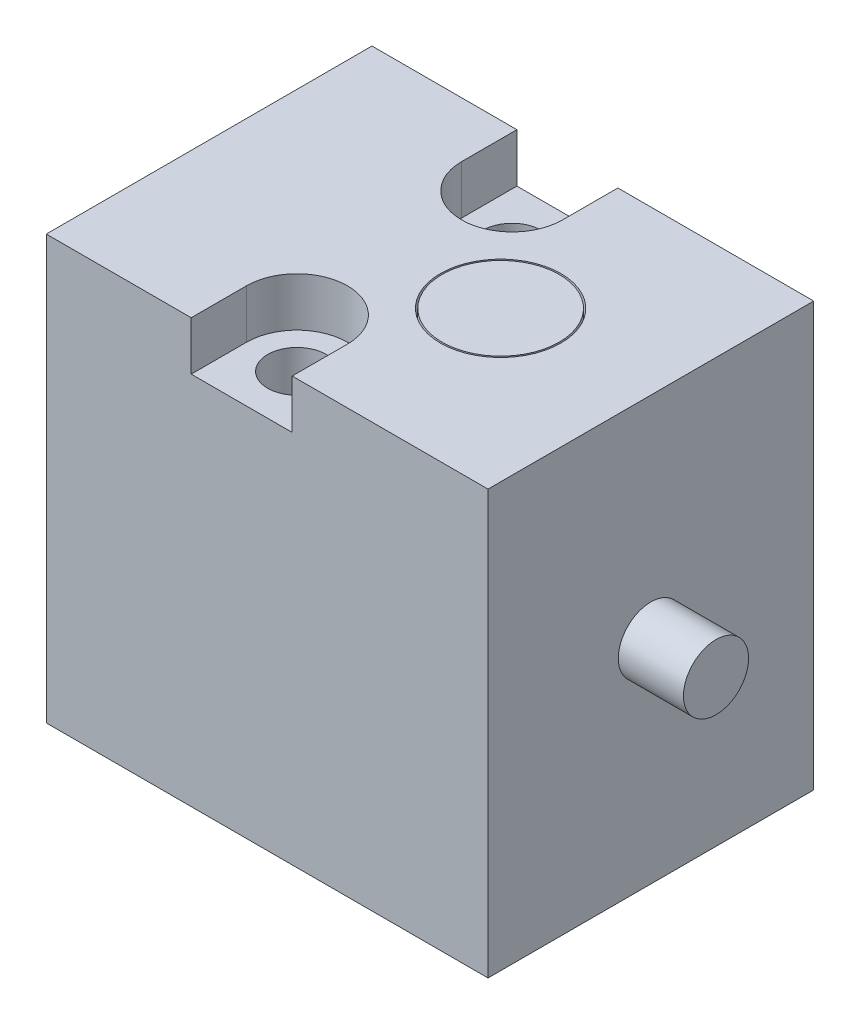
ISO-10303-21;
HEADER;
FILE_DESCRIPTION(('STEP AP214'),'2;1');
FILE_NAME('part.step','',(''),(''),'','','');
FILE_SCHEMA(('AUTOMOTIVE_DESIGN { 1 0 10303 214 1 1 1 1 }'));
ENDSEC;
DATA;
#1=APPLICATION_CONTEXT('core data for automotive mechanical design processes');
#2=APPLICATION_PROTOCOL_DEFINITION('international standard','automotive_design',2000,#1);
#3=PRODUCT_CONTEXT('',#1,'mechanical');
#4=PRODUCT('Part','Part','',(#3));
#5=PRODUCT_RELATED_PRODUCT_CATEGORY('part','',(#4));
#6=PRODUCT_DEFINITION_FORMATION('','',#4);
#7=PRODUCT_DEFINITION_CONTEXT('part definition',#1,'design');
#8=PRODUCT_DEFINITION('design','',#6,#7);
#9=PRODUCT_DEFINITION_SHAPE('','',#8);
#10=(LENGTH_UNIT() NAMED_UNIT(*) SI_UNIT(.MILLI.,.METRE.));
#11=(NAMED_UNIT(*) PLANE_ANGLE_UNIT() SI_UNIT($,.RADIAN.));
#12=(NAMED_UNIT(*) SI_UNIT($,.STERADIAN.) SOLID_ANGLE_UNIT());
#13=UNCERTAINTY_MEASURE_WITH_UNIT(LENGTH_MEASURE(1.E-05),#10,'distance_accuracy_value','');
#14=(GEOMETRIC_REPRESENTATION_CONTEXT(3) GLOBAL_UNCERTAINTY_ASSIGNED_CONTEXT((#13)) GLOBAL_UNIT_ASSIGNED_CONTEXT((#10,
#11,#12)) REPRESENTATION_CONTEXT('',''));
#15=CARTESIAN_POINT('',(0.,0.,0.));
#16=DIRECTION('',(0.,0.,1.));
#17=DIRECTION('',(1.,0.,0.));
#18=AXIS2_PLACEMENT_3D('',#15,#16,#17);
#19=CARTESIAN_POINT('',(8.95,12.75,0.));
#20=DIRECTION('',(0.,1.,0.));
#21=DIRECTION('',(1.,0.,0.));
#22=AXIS2_PLACEMENT_3D('',#19,#20,#21);
#23=CYLINDRICAL_SURFACE('',#22,1.8);
#24=CARTESIAN_POINT('',(8.95,13.,0.));
#25=DIRECTION('',(0.,1.,0.));
#26=DIRECTION('',(1.,0.,0.));
#27=AXIS2_PLACEMENT_3D('',#24,#25,#26);
#28=CIRCLE('',#27,1.8);
#29=CARTESIAN_POINT('',(10.75,13.,0.));
#30=VERTEX_POINT('',#29);
#31=EDGE_CURVE('E11',#30,#30,#28,.T.);
#32=ORIENTED_EDGE('',*,*,#31,.F.);
#33=EDGE_LOOP('',(#32));
#34=FACE_BOUND('',#33,.T.);
#35=CARTESIAN_POINT('',(8.95,12.5,0.));
#36=DIRECTION('',(0.,-1.,0.));
#37=DIRECTION('',(1.,0.,0.));
#38=AXIS2_PLACEMENT_3D('',#35,#36,#37);
#39=CIRCLE('',#38,1.8);
#40=CARTESIAN_POINT('',(10.75,12.5,0.));
#41=VERTEX_POINT('',#40);
#42=EDGE_CURVE('E195',#41,#41,#39,.T.);
#43=ORIENTED_EDGE('',*,*,#42,.F.);
#44=EDGE_LOOP('',(#43));
#45=FACE_BOUND('',#44,.T.);
#46=ADVANCED_FACE('F16',(#34,#45),#23,.T.);
#47=CARTESIAN_POINT('',(8.95,13.,0.));
#48=DIRECTION('',(0.,1.,0.));
#49=DIRECTION('',(-1.,0.,0.));
#50=AXIS2_PLACEMENT_3D('',#47,#48,#49);
#51=PLANE('',#50);
#52=ORIENTED_EDGE('',*,*,#31,.T.);
#53=EDGE_LOOP('',(#52));
#54=FACE_BOUND('',#53,.T.);
#55=ADVANCED_FACE('F346',(#54),#51,.T.);
#56=CARTESIAN_POINT('',(13.563,6.50000000000001,0.));
#57=DIRECTION('',(-1.,0.,0.));
#58=DIRECTION('',(0.,0.,-1.));
#59=AXIS2_PLACEMENT_3D('',#56,#57,#58);
#60=CYLINDRICAL_SURFACE('',#59,1.);
#61=CARTESIAN_POINT('',(15.563,6.50000000000001,0.));
#62=DIRECTION('',(1.,0.,0.));
#63=DIRECTION('',(0.,0.,-1.));
#64=AXIS2_PLACEMENT_3D('',#61,#62,#63);
#65=CIRCLE('',#64,1.);
#66=CARTESIAN_POINT('',(15.563,6.50000000000001,-1.));
#67=VERTEX_POINT('',#66);
#68=EDGE_CURVE('E25',#67,#67,#65,.T.);
#69=ORIENTED_EDGE('',*,*,#68,.F.);
#70=EDGE_LOOP('',(#69));
#71=FACE_BOUND('',#70,.T.);
#72=CARTESIAN_POINT('',(13.563,6.50000000000001,0.));
#73=DIRECTION('',(-1.,0.,0.));
#74=DIRECTION('',(0.,0.,-1.));
#75=AXIS2_PLACEMENT_3D('',#72,#73,#74);
#76=CIRCLE('',#75,1.);
#77=CARTESIAN_POINT('',(13.563,6.50000000000001,1.));
#78=VERTEX_POINT('',#77);
#79=EDGE_CURVE('E175',#78,#78,#76,.T.);
#80=ORIENTED_EDGE('',*,*,#79,.F.);
#81=EDGE_LOOP('',(#80));
#82=FACE_BOUND('',#81,.T.);
#83=ADVANCED_FACE('F350',(#71,#82),#60,.T.);
#84=CARTESIAN_POINT('',(15.563,6.50000000000001,0.));
#85=DIRECTION('',(1.,0.,0.));
#86=DIRECTION('',(0.,0.,-1.));
#87=AXIS2_PLACEMENT_3D('',#84,#85,#86);
#88=PLANE('',#87);
#89=ORIENTED_EDGE('',*,*,#68,.T.);
#90=EDGE_LOOP('',(#89));
#91=FACE_BOUND('',#90,.T.);
#92=ADVANCED_FACE('F363',(#91),#88,.T.);
#93=CARTESIAN_POINT('',(8.95,13.25,0.));
#94=DIRECTION('',(0.,1.,0.));
#95=DIRECTION('',(1.,0.,0.));
#96=AXIS2_PLACEMENT_3D('',#93,#94,#95);
#97=CYLINDRICAL_SURFACE('',#96,1.85);
#98=CARTESIAN_POINT('',(8.95,13.,0.));
#99=DIRECTION('',(0.,-1.,0.));
#100=DIRECTION('',(1.,0.,0.));
#101=AXIS2_PLACEMENT_3D('',#98,#99,#100);
#102=CIRCLE('',#101,1.85);
#103=CARTESIAN_POINT('',(7.1,13.,0.));
#104=VERTEX_POINT('',#103);
#105=EDGE_CURVE('E221',#104,#104,#102,.T.);
#106=ORIENTED_EDGE('',*,*,#105,.F.);
#107=EDGE_LOOP('',(#106));
#108=FACE_BOUND('',#107,.T.);
#109=CARTESIAN_POINT('',(8.95,12.5,0.));
#110=DIRECTION('',(0.,-1.,0.));
#111=DIRECTION('',(1.,0.,0.));
#112=AXIS2_PLACEMENT_3D('',#109,#110,#111);
#113=CIRCLE('',#112,1.85);
#114=CARTESIAN_POINT('',(10.8,12.5,0.));
#115=VERTEX_POINT('',#114);
#116=EDGE_CURVE('E198',#115,#115,#113,.T.);
#117=ORIENTED_EDGE('',*,*,#116,.T.);
#118=EDGE_LOOP('',(#117));
#119=FACE_BOUND('',#118,.T.);
#120=ADVANCED_FACE('F359',(#108,#119),#97,.F.);
#121=CARTESIAN_POINT('',(8.95,12.5,0.));
#122=DIRECTION('',(0.,-1.,0.));
#123=DIRECTION('',(1.,0.,0.));
#124=AXIS2_PLACEMENT_3D('',#121,#122,#123);
#125=PLANE('',#124);
#126=ORIENTED_EDGE('',*,*,#42,.T.);
#127=EDGE_LOOP('',(#126));
#128=FACE_BOUND('',#127,.T.);
#129=ORIENTED_EDGE('',*,*,#116,.F.);
#130=EDGE_LOOP('',(#129));
#131=FACE_BOUND('',#130,.T.);
#132=ADVANCED_FACE('F355',(#128,#131),#125,.F.);
#133=CARTESIAN_POINT('',(9.7846,2.,0.));
#134=DIRECTION('',(0.,-1.,0.));
#135=DIRECTION('',(1.,0.,0.));
#136=AXIS2_PLACEMENT_3D('',#133,#134,#135);
#137=CYLINDRICAL_SURFACE('',#136,0.6);
#138=CARTESIAN_POINT('',(9.7846,0.,0.));
#139=DIRECTION('',(0.,1.,0.));
#140=DIRECTION('',(1.,0.,0.));
#141=AXIS2_PLACEMENT_3D('',#138,#139,#140);
#142=CIRCLE('',#141,0.6);
#143=CARTESIAN_POINT('',(9.1846,0.,0.));
#144=VERTEX_POINT('',#143);
#145=EDGE_CURVE('E230',#144,#144,#142,.T.);
#146=ORIENTED_EDGE('',*,*,#145,.F.);
#147=EDGE_LOOP('',(#146));
#148=FACE_BOUND('',#147,.T.);
#149=CARTESIAN_POINT('',(9.7846,5.,0.));
#150=DIRECTION('',(0.,1.,0.));
#151=DIRECTION('',(1.,0.,0.));
#152=AXIS2_PLACEMENT_3D('',#149,#150,#151);
#153=CIRCLE('',#152,0.6);
#154=CARTESIAN_POINT('',(10.3846,5.,0.));
#155=VERTEX_POINT('',#154);
#156=EDGE_CURVE('E199',#155,#155,#153,.T.);
#157=ORIENTED_EDGE('',*,*,#156,.T.);
#158=EDGE_LOOP('',(#157));
#159=FACE_BOUND('',#158,.T.);
#160=ADVANCED_FACE('F358',(#148,#159),#137,.F.);
#161=CARTESIAN_POINT('',(9.7846,5.,0.));
#162=DIRECTION('',(0.,1.,0.));
#163=DIRECTION('',(1.,0.,0.));
#164=AXIS2_PLACEMENT_3D('',#161,#162,#163);
#165=PLANE('',#164);
#166=ORIENTED_EDGE('',*,*,#156,.F.);
#167=EDGE_LOOP('',(#166));
#168=FACE_BOUND('',#167,.T.);
#169=ADVANCED_FACE('F379',(#168),#165,.F.);
#170=CARTESIAN_POINT('',(7.143,2.,0.));
#171=DIRECTION('',(0.,-1.,0.));
#172=DIRECTION('',(1.,0.,0.));
#173=AXIS2_PLACEMENT_3D('',#170,#171,#172);
#174=CYLINDRICAL_SURFACE('',#173,0.6);
#175=CARTESIAN_POINT('',(7.143,0.,0.));
#176=DIRECTION('',(0.,1.,0.));
#177=DIRECTION('',(1.,0.,0.));
#178=AXIS2_PLACEMENT_3D('',#175,#176,#177);
#179=CIRCLE('',#178,0.6);
#180=CARTESIAN_POINT('',(6.54299999999999,0.,0.));
#181=VERTEX_POINT('',#180);
#182=EDGE_CURVE('E271',#181,#181,#179,.T.);
#183=ORIENTED_EDGE('',*,*,#182,.F.);
#184=EDGE_LOOP('',(#183));
#185=FACE_BOUND('',#184,.T.);
#186=CARTESIAN_POINT('',(7.143,5.,0.));
#187=DIRECTION('',(0.,1.,0.));
#188=DIRECTION('',(1.,0.,0.));
#189=AXIS2_PLACEMENT_3D('',#186,#187,#188);
#190=CIRCLE('',#189,0.6);
#191=CARTESIAN_POINT('',(7.743,5.,0.));
#192=VERTEX_POINT('',#191);
#193=EDGE_CURVE('E19',#192,#192,#190,.T.);
#194=ORIENTED_EDGE('',*,*,#193,.T.);
#195=EDGE_LOOP('',(#194));
#196=FACE_BOUND('',#195,.T.);
#197=ADVANCED_FACE('F382',(#185,#196),#174,.F.);
#198=CARTESIAN_POINT('',(7.143,5.,0.));
#199=DIRECTION('',(0.,1.,0.));
#200=DIRECTION('',(1.,0.,0.));
#201=AXIS2_PLACEMENT_3D('',#198,#199,#200);
#202=PLANE('',#201);
#203=ORIENTED_EDGE('',*,*,#193,.F.);
#204=EDGE_LOOP('',(#203));
#205=FACE_BOUND('',#204,.T.);
#206=ADVANCED_FACE('F416',(#205),#202,.F.);
#207=CARTESIAN_POINT('',(4.5014,2.,0.));
#208=DIRECTION('',(0.,-1.,0.));
#209=DIRECTION('',(1.,0.,0.));
#210=AXIS2_PLACEMENT_3D('',#207,#208,#209);
#211=CYLINDRICAL_SURFACE('',#210,0.6);
#212=CARTESIAN_POINT('',(4.5014,0.,0.));
#213=DIRECTION('',(0.,1.,0.));
#214=DIRECTION('',(1.,0.,0.));
#215=AXIS2_PLACEMENT_3D('',#212,#213,#214);
#216=CIRCLE('',#215,0.6);
#217=CARTESIAN_POINT('',(3.9014,0.,0.));
#218=VERTEX_POINT('',#217);
#219=EDGE_CURVE('E220',#218,#218,#216,.T.);
#220=ORIENTED_EDGE('',*,*,#219,.F.);
#221=EDGE_LOOP('',(#220));
#222=FACE_BOUND('',#221,.T.);
#223=CARTESIAN_POINT('',(4.5014,5.,0.));
#224=DIRECTION('',(0.,1.,0.));
#225=DIRECTION('',(1.,0.,0.));
#226=AXIS2_PLACEMENT_3D('',#223,#224,#225);
#227=CIRCLE('',#226,0.6);
#228=CARTESIAN_POINT('',(5.10140000000001,5.,0.));
#229=VERTEX_POINT('',#228);
#230=EDGE_CURVE('E240',#229,#229,#227,.T.);
#231=ORIENTED_EDGE('',*,*,#230,.T.);
#232=EDGE_LOOP('',(#231));
#233=FACE_BOUND('',#232,.T.);
#234=ADVANCED_FACE('F444',(#222,#233),#211,.F.);
#235=CARTESIAN_POINT('',(4.5014,5.,0.));
#236=DIRECTION('',(0.,1.,0.));
#237=DIRECTION('',(1.,0.,0.));
#238=AXIS2_PLACEMENT_3D('',#235,#236,#237);
#239=PLANE('',#238);
#240=ORIENTED_EDGE('',*,*,#230,.F.);
#241=EDGE_LOOP('',(#240));
#242=FACE_BOUND('',#241,.T.);
#243=ADVANCED_FACE('F377',(#242),#239,.F.);
#244=CARTESIAN_POINT('',(-0.375,6.50000000000001,0.));
#245=DIRECTION('',(-1.,0.,0.));
#246=DIRECTION('',(0.,0.,-1.));
#247=AXIS2_PLACEMENT_3D('',#244,#245,#246);
#248=CYLINDRICAL_SURFACE('',#247,3.4);
#249=CARTESIAN_POINT('',(0.,6.50000000000001,0.));
#250=DIRECTION('',(1.,0.,0.));
#251=DIRECTION('',(0.,0.,-1.));
#252=AXIS2_PLACEMENT_3D('',#249,#250,#251);
#253=CIRCLE('',#252,3.4);
#254=CARTESIAN_POINT('',(0.,6.50000000000001,3.39999999999999));
#255=VERTEX_POINT('',#254);
#256=EDGE_CURVE('E190',#255,#255,#253,.T.);
#257=ORIENTED_EDGE('',*,*,#256,.F.);
#258=EDGE_LOOP('',(#257));
#259=FACE_BOUND('',#258,.T.);
#260=CARTESIAN_POINT('',(0.25,6.50000000000001,0.));
#261=DIRECTION('',(1.,0.,0.));
#262=DIRECTION('',(0.,0.,-1.));
#263=AXIS2_PLACEMENT_3D('',#260,#261,#262);
#264=CIRCLE('',#263,3.4);
#265=CARTESIAN_POINT('',(0.25,6.50000000000001,-3.39999999999999));
#266=VERTEX_POINT('',#265);
#267=EDGE_CURVE('E243',#266,#266,#264,.T.);
#268=ORIENTED_EDGE('',*,*,#267,.T.);
#269=EDGE_LOOP('',(#268));
#270=FACE_BOUND('',#269,.T.);
#271=ADVANCED_FACE('F373',(#259,#270),#248,.F.);
#272=CARTESIAN_POINT('',(0.25,6.50000000000001,0.));
#273=DIRECTION('',(1.,0.,0.));
#274=DIRECTION('',(0.,0.,-1.));
#275=AXIS2_PLACEMENT_3D('',#272,#273,#274);
#276=PLANE('',#275);
#277=ORIENTED_EDGE('',*,*,#267,.F.);
#278=EDGE_LOOP('',(#277));
#279=FACE_BOUND('',#278,.T.);
#280=ADVANCED_FACE('F376',(#279),#276,.F.);
#281=CARTESIAN_POINT('',(6.00000000000001,7.00000000000001,3.302));
#282=DIRECTION('',(0.,-1.,0.));
#283=DIRECTION('',(1.,0.,0.));
#284=AXIS2_PLACEMENT_3D('',#281,#282,#283);
#285=CYLINDRICAL_SURFACE('',#284,0.9);
#286=CARTESIAN_POINT('',(6.00000000000001,0.,3.302));
#287=DIRECTION('',(0.,1.,0.));
#288=DIRECTION('',(1.,0.,0.));
#289=AXIS2_PLACEMENT_3D('',#286,#287,#288);
#290=CIRCLE('',#289,0.9);
#291=CARTESIAN_POINT('',(5.09999999999999,0.,3.302));
#292=VERTEX_POINT('',#291);
#293=EDGE_CURVE('E217',#292,#292,#290,.T.);
#294=ORIENTED_EDGE('',*,*,#293,.F.);
#295=EDGE_LOOP('',(#294));
#296=FACE_BOUND('',#295,.T.);
#297=CARTESIAN_POINT('',(6.00000000000001,11.5,3.302));
#298=DIRECTION('',(0.,-1.,0.));
#299=DIRECTION('',(1.,0.,0.));
#300=AXIS2_PLACEMENT_3D('',#297,#298,#299);
#301=CIRCLE('',#300,0.9);
#302=CARTESIAN_POINT('',(5.09999999999999,11.5,3.302));
#303=VERTEX_POINT('',#302);
#304=EDGE_CURVE('E253',#303,#303,#301,.T.);
#305=ORIENTED_EDGE('',*,*,#304,.F.);
#306=EDGE_LOOP('',(#305));
#307=FACE_BOUND('',#306,.T.);
#308=ADVANCED_FACE('F401',(#296,#307),#285,.F.);
#309=CARTESIAN_POINT('',(6.00000000000001,7.00000000000001,-3.302));
#310=DIRECTION('',(0.,-1.,0.));
#311=DIRECTION('',(1.,0.,0.));
#312=AXIS2_PLACEMENT_3D('',#309,#310,#311);
#313=CYLINDRICAL_SURFACE('',#312,0.9);
#314=CARTESIAN_POINT('',(6.00000000000001,0.,-3.302));
#315=DIRECTION('',(0.,1.,0.));
#316=DIRECTION('',(1.,0.,0.));
#317=AXIS2_PLACEMENT_3D('',#314,#315,#316);
#318=CIRCLE('',#317,0.9);
#319=CARTESIAN_POINT('',(5.09999999999999,0.,-3.302));
#320=VERTEX_POINT('',#319);
#321=EDGE_CURVE('E189',#320,#320,#318,.T.);
#322=ORIENTED_EDGE('',*,*,#321,.F.);
#323=EDGE_LOOP('',(#322));
#324=FACE_BOUND('',#323,.T.);
#325=CARTESIAN_POINT('',(6.00000000000001,11.5,-3.302));
#326=DIRECTION('',(0.,-1.,0.));
#327=DIRECTION('',(1.,0.,0.));
#328=AXIS2_PLACEMENT_3D('',#325,#326,#327);
#329=CIRCLE('',#328,0.9);
#330=CARTESIAN_POINT('',(5.09999999999999,11.5,-3.302));
#331=VERTEX_POINT('',#330);
#332=EDGE_CURVE('E183',#331,#331,#329,.T.);
#333=ORIENTED_EDGE('',*,*,#332,.F.);
#334=EDGE_LOOP('',(#333));
#335=FACE_BOUND('',#334,.T.);
#336=ADVANCED_FACE('F406',(#324,#335),#313,.F.);
#337=CARTESIAN_POINT('',(6.00000000000001,12.75,3.302));
#338=DIRECTION('',(0.,1.,0.));
#339=DIRECTION('',(1.,0.,0.));
#340=AXIS2_PLACEMENT_3D('',#337,#338,#339);
#341=CYLINDRICAL_SURFACE('',#340,1.55);
#342=CARTESIAN_POINT('',(6.00000000000001,13.,3.302));
#343=DIRECTION('',(0.,-1.,0.));
#344=DIRECTION('',(1.,0.,0.));
#345=AXIS2_PLACEMENT_3D('',#342,#343,#344);
#346=CIRCLE('',#345,1.55);
#347=CARTESIAN_POINT('',(4.45,13.,3.302));
#348=VERTEX_POINT('',#347);
#349=CARTESIAN_POINT('',(7.55,13.,3.302));
#350=VERTEX_POINT('',#349);
#351=EDGE_CURVE('E247',#348,#350,#346,.T.);
#352=ORIENTED_EDGE('',*,*,#351,.F.);
#353=DIRECTION('',(0.,1.,0.));
#354=VECTOR('',#353,1.);
#355=CARTESIAN_POINT('',(4.45,12.75,3.302));
#356=LINE('',#355,#354);
#357=CARTESIAN_POINT('',(4.45,11.5,3.302));
#358=VERTEX_POINT('',#357);
#359=EDGE_CURVE('E269',#358,#348,#356,.T.);
#360=ORIENTED_EDGE('',*,*,#359,.F.);
#361=CARTESIAN_POINT('',(6.00000000000001,11.5,3.302));
#362=DIRECTION('',(0.,-1.,0.));
#363=DIRECTION('',(1.,0.,0.));
#364=AXIS2_PLACEMENT_3D('',#361,#362,#363);
#365=CIRCLE('',#364,1.55);
#366=CARTESIAN_POINT('',(7.55,11.5,3.302));
#367=VERTEX_POINT('',#366);
#368=EDGE_CURVE('E214',#358,#367,#365,.T.);
#369=ORIENTED_EDGE('',*,*,#368,.T.);
#370=DIRECTION('',(0.,-1.,0.));
#371=VECTOR('',#370,1.);
#372=CARTESIAN_POINT('',(7.55,12.75,3.302));
#373=LINE('',#372,#371);
#374=EDGE_CURVE('E212',#350,#367,#373,.T.);
#375=ORIENTED_EDGE('',*,*,#374,.F.);
#376=EDGE_LOOP('',(#352,#360,#369,#375));
#377=FACE_BOUND('',#376,.T.);
#378=ADVANCED_FACE('F309',(#377),#341,.F.);
#379=CARTESIAN_POINT('',(7.55,14.,5.802));
#380=DIRECTION('',(-1.,0.,0.));
#381=DIRECTION('',(0.,0.,1.));
#382=AXIS2_PLACEMENT_3D('',#379,#380,#381);
#383=PLANE('',#382);
#384=DIRECTION('',(0.,0.,1.));
#385=VECTOR('',#384,1.);
#386=CARTESIAN_POINT('',(7.55,13.,2.90099999999999));
#387=LINE('',#386,#385);
#388=CARTESIAN_POINT('',(7.55,13.,5.));
#389=VERTEX_POINT('',#388);
#390=EDGE_CURVE('E244',#350,#389,#387,.T.);
#391=ORIENTED_EDGE('',*,*,#390,.F.);
#392=ORIENTED_EDGE('',*,*,#374,.T.);
#393=DIRECTION('',(0.,0.,-1.));
#394=VECTOR('',#393,1.);
#395=CARTESIAN_POINT('',(7.55,11.5,5.802));
#396=LINE('',#395,#394);
#397=CARTESIAN_POINT('',(7.55,11.5,5.));
#398=VERTEX_POINT('',#397);
#399=EDGE_CURVE('E224',#398,#367,#396,.T.);
#400=ORIENTED_EDGE('',*,*,#399,.F.);
#401=DIRECTION('',(0.,-1.,0.));
#402=VECTOR('',#401,1.);
#403=CARTESIAN_POINT('',(7.55,10.25,5.));
#404=LINE('',#403,#402);
#405=EDGE_CURVE('E229',#389,#398,#404,.T.);
#406=ORIENTED_EDGE('',*,*,#405,.F.);
#407=EDGE_LOOP('',(#391,#392,#400,#406));
#408=FACE_BOUND('',#407,.T.);
#409=ADVANCED_FACE('F313',(#408),#383,.T.);
#410=CARTESIAN_POINT('',(4.45,14.,5.802));
#411=DIRECTION('',(1.,0.,0.));
#412=DIRECTION('',(0.,0.,-1.));
#413=AXIS2_PLACEMENT_3D('',#410,#411,#412);
#414=PLANE('',#413);
#415=DIRECTION('',(0.,0.,-1.));
#416=VECTOR('',#415,1.);
#417=CARTESIAN_POINT('',(4.45,13.,2.90099999999999));
#418=LINE('',#417,#416);
#419=CARTESIAN_POINT('',(4.45,13.,5.));
#420=VERTEX_POINT('',#419);
#421=EDGE_CURVE('E225',#420,#348,#418,.T.);
#422=ORIENTED_EDGE('',*,*,#421,.F.);
#423=DIRECTION('',(0.,1.,0.));
#424=VECTOR('',#423,1.);
#425=CARTESIAN_POINT('',(4.45,10.25,5.));
#426=LINE('',#425,#424);
#427=CARTESIAN_POINT('',(4.45,11.5,5.));
#428=VERTEX_POINT('',#427);
#429=EDGE_CURVE('E254',#428,#420,#426,.T.);
#430=ORIENTED_EDGE('',*,*,#429,.F.);
#431=DIRECTION('',(0.,0.,-1.));
#432=VECTOR('',#431,1.);
#433=CARTESIAN_POINT('',(4.45,11.5,5.802));
#434=LINE('',#433,#432);
#435=EDGE_CURVE('E215',#428,#358,#434,.T.);
#436=ORIENTED_EDGE('',*,*,#435,.T.);
#437=ORIENTED_EDGE('',*,*,#359,.T.);
#438=EDGE_LOOP('',(#422,#430,#436,#437));
#439=FACE_BOUND('',#438,.T.);
#440=ADVANCED_FACE('F388',(#439),#414,.T.);
#441=CARTESIAN_POINT('',(6.00000000000001,11.5,3.302));
#442=DIRECTION('',(0.,-1.,0.));
#443=DIRECTION('',(1.,0.,0.));
#444=AXIS2_PLACEMENT_3D('',#441,#442,#443);
#445=PLANE('',#444);
#446=ORIENTED_EDGE('',*,*,#304,.T.);
#447=EDGE_LOOP('',(#446));
#448=FACE_BOUND('',#447,.T.);
#449=DIRECTION('',(-1.,0.,0.));
#450=VECTOR('',#449,1.);
#451=CARTESIAN_POINT('',(6.39075,11.5,5.));
#452=LINE('',#451,#450);
#453=EDGE_CURVE('E226',#398,#428,#452,.T.);
#454=ORIENTED_EDGE('',*,*,#453,.F.);
#455=ORIENTED_EDGE('',*,*,#399,.T.);
#456=ORIENTED_EDGE('',*,*,#368,.F.);
#457=ORIENTED_EDGE('',*,*,#435,.F.);
#458=EDGE_LOOP('',(#454,#455,#456,#457));
#459=FACE_BOUND('',#458,.T.);
#460=ADVANCED_FACE('F391',(#448,#459),#445,.F.);
#461=CARTESIAN_POINT('',(6.7815,13.,0.));
#462=DIRECTION('',(0.,-1.,0.));
#463=DIRECTION('',(0.,0.,-1.));
#464=AXIS2_PLACEMENT_3D('',#461,#462,#463);
#465=PLANE('',#464);
#466=ORIENTED_EDGE('',*,*,#105,.T.);
#467=EDGE_LOOP('',(#466));
#468=FACE_BOUND('',#467,.T.);
#469=ORIENTED_EDGE('',*,*,#421,.T.);
#470=ORIENTED_EDGE('',*,*,#351,.T.);
#471=ORIENTED_EDGE('',*,*,#390,.T.);
#472=DIRECTION('',(-1.,0.,0.));
#473=VECTOR('',#472,1.);
#474=CARTESIAN_POINT('',(6.7815,13.,5.));
#475=LINE('',#474,#473);
#476=CARTESIAN_POINT('',(13.563,13.,5.));
#477=VERTEX_POINT('',#476);
#478=EDGE_CURVE('E160',#477,#389,#475,.T.);
#479=ORIENTED_EDGE('',*,*,#478,.F.);
#480=DIRECTION('',(0.,0.,-1.));
#481=VECTOR('',#480,1.);
#482=CARTESIAN_POINT('',(13.563,13.,0.));
#483=LINE('',#482,#481);
#484=CARTESIAN_POINT('',(13.563,13.,-5.));
#485=VERTEX_POINT('',#484);
#486=EDGE_CURVE('E156',#477,#485,#483,.T.);
#487=ORIENTED_EDGE('',*,*,#486,.T.);
#488=DIRECTION('',(1.,0.,0.));
#489=VECTOR('',#488,1.);
#490=CARTESIAN_POINT('',(6.7815,13.,-5.));
#491=LINE('',#490,#489);
#492=CARTESIAN_POINT('',(7.55,13.,-5.));
#493=VERTEX_POINT('',#492);
#494=EDGE_CURVE('E194',#493,#485,#491,.T.);
#495=ORIENTED_EDGE('',*,*,#494,.F.);
#496=DIRECTION('',(0.,0.,1.));
#497=VECTOR('',#496,1.);
#498=CARTESIAN_POINT('',(7.55,13.,-2.90099999999999));
#499=LINE('',#498,#497);
#500=CARTESIAN_POINT('',(7.55,13.,-3.302));
#501=VERTEX_POINT('',#500);
#502=EDGE_CURVE('E266',#493,#501,#499,.T.);
#503=ORIENTED_EDGE('',*,*,#502,.T.);
#504=CARTESIAN_POINT('',(6.00000000000001,13.,-3.302));
#505=DIRECTION('',(0.,-1.,0.));
#506=DIRECTION('',(1.,0.,0.));
#507=AXIS2_PLACEMENT_3D('',#504,#505,#506);
#508=CIRCLE('',#507,1.55);
#509=CARTESIAN_POINT('',(4.45,13.,-3.302));
#510=VERTEX_POINT('',#509);
#511=EDGE_CURVE('E203',#501,#510,#508,.T.);
#512=ORIENTED_EDGE('',*,*,#511,.T.);
#513=DIRECTION('',(0.,0.,-1.));
#514=VECTOR('',#513,1.);
#515=CARTESIAN_POINT('',(4.45,13.,-2.90099999999999));
#516=LINE('',#515,#514);
#517=CARTESIAN_POINT('',(4.45,13.,-5.));
#518=VERTEX_POINT('',#517);
#519=EDGE_CURVE('E200',#510,#518,#516,.T.);
#520=ORIENTED_EDGE('',*,*,#519,.T.);
#521=DIRECTION('',(1.,0.,0.));
#522=VECTOR('',#521,1.);
#523=CARTESIAN_POINT('',(6.7815,13.,-5.));
#524=LINE('',#523,#522);
#525=CARTESIAN_POINT('',(0.,13.,-5.));
#526=VERTEX_POINT('',#525);
#527=EDGE_CURVE('E233',#526,#518,#524,.T.);
#528=ORIENTED_EDGE('',*,*,#527,.F.);
#529=DIRECTION('',(0.,0.,-1.));
#530=VECTOR('',#529,1.);
#531=CARTESIAN_POINT('',(0.,13.,0.));
#532=LINE('',#531,#530);
#533=CARTESIAN_POINT('',(0.,13.,5.));
#534=VERTEX_POINT('',#533);
#535=EDGE_CURVE('E178',#534,#526,#532,.T.);
#536=ORIENTED_EDGE('',*,*,#535,.F.);
#537=DIRECTION('',(-1.,0.,0.));
#538=VECTOR('',#537,1.);
#539=CARTESIAN_POINT('',(6.7815,13.,5.));
#540=LINE('',#539,#538);
#541=EDGE_CURVE('E256',#420,#534,#540,.T.);
#542=ORIENTED_EDGE('',*,*,#541,.F.);
#543=EDGE_LOOP('',(#469,#470,#471,#479,#487,#495,#503,#512,#520,#528,#536,#542));
#544=FACE_BOUND('',#543,.T.);
#545=ADVANCED_FACE('F304',(#468,#544),#465,.F.);
#546=CARTESIAN_POINT('',(4.45,14.,-5.802));
#547=DIRECTION('',(1.,0.,0.));
#548=DIRECTION('',(0.,0.,-1.));
#549=AXIS2_PLACEMENT_3D('',#546,#547,#548);
#550=PLANE('',#549);
#551=ORIENTED_EDGE('',*,*,#519,.F.);
#552=DIRECTION('',(0.,-1.,0.));
#553=VECTOR('',#552,1.);
#554=CARTESIAN_POINT('',(4.45,12.75,-3.302));
#555=LINE('',#554,#553);
#556=CARTESIAN_POINT('',(4.45,11.5,-3.302));
#557=VERTEX_POINT('',#556);
#558=EDGE_CURVE('E204',#510,#557,#555,.T.);
#559=ORIENTED_EDGE('',*,*,#558,.T.);
#560=DIRECTION('',(0.,0.,-1.));
#561=VECTOR('',#560,1.);
#562=CARTESIAN_POINT('',(4.45,11.5,-5.802));
#563=LINE('',#562,#561);
#564=CARTESIAN_POINT('',(4.45,11.5,-5.));
#565=VERTEX_POINT('',#564);
#566=EDGE_CURVE('E186',#557,#565,#563,.T.);
#567=ORIENTED_EDGE('',*,*,#566,.T.);
#568=DIRECTION('',(0.,-1.,0.));
#569=VECTOR('',#568,1.);
#570=CARTESIAN_POINT('',(4.45,10.25,-5.));
#571=LINE('',#570,#569);
#572=EDGE_CURVE('E234',#518,#565,#571,.T.);
#573=ORIENTED_EDGE('',*,*,#572,.F.);
#574=EDGE_LOOP('',(#551,#559,#567,#573));
#575=FACE_BOUND('',#574,.T.);
#576=ADVANCED_FACE('F330',(#575),#550,.T.);
#577=CARTESIAN_POINT('',(6.00000000000001,11.5,-3.302));
#578=DIRECTION('',(0.,-1.,0.));
#579=DIRECTION('',(1.,0.,0.));
#580=AXIS2_PLACEMENT_3D('',#577,#578,#579);
#581=PLANE('',#580);
#582=ORIENTED_EDGE('',*,*,#332,.T.);
#583=EDGE_LOOP('',(#582));
#584=FACE_BOUND('',#583,.T.);
#585=DIRECTION('',(1.,0.,0.));
#586=VECTOR('',#585,1.);
#587=CARTESIAN_POINT('',(6.39075,11.5,-5.));
#588=LINE('',#587,#586);
#589=CARTESIAN_POINT('',(7.55,11.5,-5.));
#590=VERTEX_POINT('',#589);
#591=EDGE_CURVE('E237',#565,#590,#588,.T.);
#592=ORIENTED_EDGE('',*,*,#591,.F.);
#593=ORIENTED_EDGE('',*,*,#566,.F.);
#594=CARTESIAN_POINT('',(6.00000000000001,11.5,-3.302));
#595=DIRECTION('',(0.,-1.,0.));
#596=DIRECTION('',(1.,0.,0.));
#597=AXIS2_PLACEMENT_3D('',#594,#595,#596);
#598=CIRCLE('',#597,1.55);
#599=CARTESIAN_POINT('',(7.55,11.5,-3.302));
#600=VERTEX_POINT('',#599);
#601=EDGE_CURVE('E236',#600,#557,#598,.T.);
#602=ORIENTED_EDGE('',*,*,#601,.F.);
#603=DIRECTION('',(0.,0.,-1.));
#604=VECTOR('',#603,1.);
#605=CARTESIAN_POINT('',(7.55,11.5,-5.802));
#606=LINE('',#605,#604);
#607=EDGE_CURVE('E187',#600,#590,#606,.T.);
#608=ORIENTED_EDGE('',*,*,#607,.T.);
#609=EDGE_LOOP('',(#592,#593,#602,#608));
#610=FACE_BOUND('',#609,.T.);
#611=ADVANCED_FACE('F384',(#584,#610),#581,.F.);
#612=CARTESIAN_POINT('',(7.55,14.,-5.802));
#613=DIRECTION('',(-1.,0.,0.));
#614=DIRECTION('',(0.,0.,1.));
#615=AXIS2_PLACEMENT_3D('',#612,#613,#614);
#616=PLANE('',#615);
#617=ORIENTED_EDGE('',*,*,#502,.F.);
#618=DIRECTION('',(0.,1.,0.));
#619=VECTOR('',#618,1.);
#620=CARTESIAN_POINT('',(7.55,10.25,-5.));
#621=LINE('',#620,#619);
#622=EDGE_CURVE('E206',#590,#493,#621,.T.);
#623=ORIENTED_EDGE('',*,*,#622,.F.);
#624=ORIENTED_EDGE('',*,*,#607,.F.);
#625=DIRECTION('',(0.,1.,0.));
#626=VECTOR('',#625,1.);
#627=CARTESIAN_POINT('',(7.55,12.75,-3.302));
#628=LINE('',#627,#626);
#629=EDGE_CURVE('E209',#600,#501,#628,.T.);
#630=ORIENTED_EDGE('',*,*,#629,.T.);
#631=EDGE_LOOP('',(#617,#623,#624,#630));
#632=FACE_BOUND('',#631,.T.);
#633=ADVANCED_FACE('F322',(#632),#616,.T.);
#634=CARTESIAN_POINT('',(6.00000000000001,12.75,-3.302));
#635=DIRECTION('',(0.,1.,0.));
#636=DIRECTION('',(1.,0.,0.));
#637=AXIS2_PLACEMENT_3D('',#634,#635,#636);
#638=CYLINDRICAL_SURFACE('',#637,1.55);
#639=ORIENTED_EDGE('',*,*,#511,.F.);
#640=ORIENTED_EDGE('',*,*,#629,.F.);
#641=ORIENTED_EDGE('',*,*,#601,.T.);
#642=ORIENTED_EDGE('',*,*,#558,.F.);
#643=EDGE_LOOP('',(#639,#640,#641,#642));
#644=FACE_BOUND('',#643,.T.);
#645=ADVANCED_FACE('F328',(#644),#638,.F.);
#646=CARTESIAN_POINT('',(6.7815,6.50000000000001,-5.));
#647=DIRECTION('',(0.,0.,1.));
#648=DIRECTION('',(1.,0.,0.));
#649=AXIS2_PLACEMENT_3D('',#646,#647,#648);
#650=PLANE('',#649);
#651=ORIENTED_EDGE('',*,*,#572,.T.);
#652=ORIENTED_EDGE('',*,*,#591,.T.);
#653=ORIENTED_EDGE('',*,*,#622,.T.);
#654=ORIENTED_EDGE('',*,*,#494,.T.);
#655=DIRECTION('',(0.,-1.,0.));
#656=VECTOR('',#655,1.);
#657=CARTESIAN_POINT('',(13.563,6.50000000000001,-5.));
#658=LINE('',#657,#656);
#659=CARTESIAN_POINT('',(13.563,0.,-5.));
#660=VERTEX_POINT('',#659);
#661=EDGE_CURVE('E192',#485,#660,#658,.T.);
#662=ORIENTED_EDGE('',*,*,#661,.T.);
#663=DIRECTION('',(-1.,0.,0.));
#664=VECTOR('',#663,1.);
#665=CARTESIAN_POINT('',(6.7815,0.,-5.));
#666=LINE('',#665,#664);
#667=CARTESIAN_POINT('',(0.,0.,-5.));
#668=VERTEX_POINT('',#667);
#669=EDGE_CURVE('E173',#660,#668,#666,.T.);
#670=ORIENTED_EDGE('',*,*,#669,.T.);
#671=DIRECTION('',(0.,1.,0.));
#672=VECTOR('',#671,1.);
#673=CARTESIAN_POINT('',(0.,6.50000000000001,-5.));
#674=LINE('',#673,#672);
#675=EDGE_CURVE('E211',#668,#526,#674,.T.);
#676=ORIENTED_EDGE('',*,*,#675,.T.);
#677=ORIENTED_EDGE('',*,*,#527,.T.);
#678=EDGE_LOOP('',(#651,#652,#653,#654,#662,#670,#676,#677));
#679=FACE_BOUND('',#678,.T.);
#680=ADVANCED_FACE('F317',(#679),#650,.F.);
#681=CARTESIAN_POINT('',(6.7815,6.50000000000001,5.));
#682=DIRECTION('',(0.,0.,1.));
#683=DIRECTION('',(1.,0.,0.));
#684=AXIS2_PLACEMENT_3D('',#681,#682,#683);
#685=PLANE('',#684);
#686=ORIENTED_EDGE('',*,*,#429,.T.);
#687=ORIENTED_EDGE('',*,*,#541,.T.);
#688=DIRECTION('',(0.,-1.,0.));
#689=VECTOR('',#688,1.);
#690=CARTESIAN_POINT('',(0.,6.50000000000001,5.));
#691=LINE('',#690,#689);
#692=CARTESIAN_POINT('',(0.,0.,5.));
#693=VERTEX_POINT('',#692);
#694=EDGE_CURVE('E166',#534,#693,#691,.T.);
#695=ORIENTED_EDGE('',*,*,#694,.T.);
#696=DIRECTION('',(1.,0.,0.));
#697=VECTOR('',#696,1.);
#698=CARTESIAN_POINT('',(6.7815,0.,5.));
#699=LINE('',#698,#697);
#700=CARTESIAN_POINT('',(13.563,0.,5.));
#701=VERTEX_POINT('',#700);
#702=EDGE_CURVE('E159',#693,#701,#699,.T.);
#703=ORIENTED_EDGE('',*,*,#702,.T.);
#704=DIRECTION('',(0.,1.,0.));
#705=VECTOR('',#704,1.);
#706=CARTESIAN_POINT('',(13.563,6.50000000000001,5.));
#707=LINE('',#706,#705);
#708=EDGE_CURVE('E149',#701,#477,#707,.T.);
#709=ORIENTED_EDGE('',*,*,#708,.T.);
#710=ORIENTED_EDGE('',*,*,#478,.T.);
#711=ORIENTED_EDGE('',*,*,#405,.T.);
#712=ORIENTED_EDGE('',*,*,#453,.T.);
#713=EDGE_LOOP('',(#686,#687,#695,#703,#709,#710,#711,#712));
#714=FACE_BOUND('',#713,.T.);
#715=ADVANCED_FACE('F163',(#714),#685,.T.);
#716=CARTESIAN_POINT('',(6.7815,0.,0.));
#717=DIRECTION('',(0.,1.,0.));
#718=DIRECTION('',(0.,0.,1.));
#719=AXIS2_PLACEMENT_3D('',#716,#717,#718);
#720=PLANE('',#719);
#721=ORIENTED_EDGE('',*,*,#145,.T.);
#722=EDGE_LOOP('',(#721));
#723=FACE_BOUND('',#722,.T.);
#724=ORIENTED_EDGE('',*,*,#182,.T.);
#725=EDGE_LOOP('',(#724));
#726=FACE_BOUND('',#725,.T.);
#727=ORIENTED_EDGE('',*,*,#219,.T.);
#728=EDGE_LOOP('',(#727));
#729=FACE_BOUND('',#728,.T.);
#730=ORIENTED_EDGE('',*,*,#293,.T.);
#731=EDGE_LOOP('',(#730));
#732=FACE_BOUND('',#731,.T.);
#733=ORIENTED_EDGE('',*,*,#321,.T.);
#734=EDGE_LOOP('',(#733));
#735=FACE_BOUND('',#734,.T.);
#736=DIRECTION('',(0.,0.,-1.));
#737=VECTOR('',#736,1.);
#738=CARTESIAN_POINT('',(0.,0.,0.));
#739=LINE('',#738,#737);
#740=EDGE_CURVE('E188',#693,#668,#739,.T.);
#741=ORIENTED_EDGE('',*,*,#740,.T.);
#742=ORIENTED_EDGE('',*,*,#669,.F.);
#743=DIRECTION('',(0.,0.,-1.));
#744=VECTOR('',#743,1.);
#745=CARTESIAN_POINT('',(13.563,0.,0.));
#746=LINE('',#745,#744);
#747=EDGE_CURVE('E154',#701,#660,#746,.T.);
#748=ORIENTED_EDGE('',*,*,#747,.F.);
#749=ORIENTED_EDGE('',*,*,#702,.F.);
#750=EDGE_LOOP('',(#741,#742,#748,#749));
#751=FACE_BOUND('',#750,.T.);
#752=ADVANCED_FACE('F171',(#723,#726,#729,#732,#735,#751),#720,.F.);
#753=CARTESIAN_POINT('',(0.,6.50000000000001,0.));
#754=DIRECTION('',(1.,0.,0.));
#755=DIRECTION('',(0.,0.,-1.));
#756=AXIS2_PLACEMENT_3D('',#753,#754,#755);
#757=PLANE('',#756);
#758=ORIENTED_EDGE('',*,*,#256,.T.);
#759=EDGE_LOOP('',(#758));
#760=FACE_BOUND('',#759,.T.);
#761=ORIENTED_EDGE('',*,*,#535,.T.);
#762=ORIENTED_EDGE('',*,*,#675,.F.);
#763=ORIENTED_EDGE('',*,*,#740,.F.);
#764=ORIENTED_EDGE('',*,*,#694,.F.);
#765=EDGE_LOOP('',(#761,#762,#763,#764));
#766=FACE_BOUND('',#765,.T.);
#767=ADVANCED_FACE('F332',(#760,#766),#757,.F.);
#768=CARTESIAN_POINT('',(13.563,6.50000000000001,0.));
#769=DIRECTION('',(-1.,0.,0.));
#770=DIRECTION('',(0.,0.,1.));
#771=AXIS2_PLACEMENT_3D('',#768,#769,#770);
#772=PLANE('',#771);
#773=ORIENTED_EDGE('',*,*,#79,.T.);
#774=EDGE_LOOP('',(#773));
#775=FACE_BOUND('',#774,.T.);
#776=ORIENTED_EDGE('',*,*,#747,.T.);
#777=ORIENTED_EDGE('',*,*,#661,.F.);
#778=ORIENTED_EDGE('',*,*,#486,.F.);
#779=ORIENTED_EDGE('',*,*,#708,.F.);
#780=EDGE_LOOP('',(#776,#777,#778,#779));
#781=FACE_BOUND('',#780,.T.);
#782=ADVANCED_FACE('F151',(#775,#781),#772,.F.);
#783=CLOSED_SHELL('',(#46,#55,#83,#92,#120,#132,#160,#169,#197,#206,#234,#243,#271,#280,#308,
#336,#378,#409,#440,#460,#545,#576,#611,#633,#645,#680,#715,#752,#767,#782));
#784=MANIFOLD_SOLID_BREP('B1',#783);
#785=ADVANCED_BREP_SHAPE_REPRESENTATION('',(#18,#784),#14);
#786=SHAPE_DEFINITION_REPRESENTATION(#9,#785);
ENDSEC;
END-ISO-10303-21;
